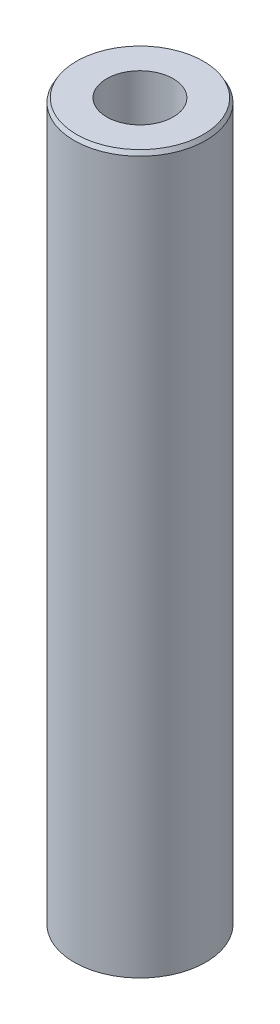
ISO-10303-21;
HEADER;
FILE_DESCRIPTION(('STEP AP214'),'2;1');
FILE_NAME('part.step','',(''),(''),'','','');
FILE_SCHEMA(('AUTOMOTIVE_DESIGN { 1 0 10303 214 1 1 1 1 }'));
ENDSEC;
DATA;
#1=APPLICATION_CONTEXT('core data for automotive mechanical design processes');
#2=APPLICATION_PROTOCOL_DEFINITION('international standard','automotive_design',2000,#1);
#3=PRODUCT_CONTEXT('',#1,'mechanical');
#4=PRODUCT('Part','Part','',(#3));
#5=PRODUCT_RELATED_PRODUCT_CATEGORY('part','',(#4));
#6=PRODUCT_DEFINITION_FORMATION('','',#4);
#7=PRODUCT_DEFINITION_CONTEXT('part definition',#1,'design');
#8=PRODUCT_DEFINITION('design','',#6,#7);
#9=PRODUCT_DEFINITION_SHAPE('','',#8);
#10=(LENGTH_UNIT() NAMED_UNIT(*) SI_UNIT(.MILLI.,.METRE.));
#11=(NAMED_UNIT(*) PLANE_ANGLE_UNIT() SI_UNIT($,.RADIAN.));
#12=(NAMED_UNIT(*) SI_UNIT($,.STERADIAN.) SOLID_ANGLE_UNIT());
#13=UNCERTAINTY_MEASURE_WITH_UNIT(LENGTH_MEASURE(1.E-05),#10,'distance_accuracy_value','');
#14=(GEOMETRIC_REPRESENTATION_CONTEXT(3) GLOBAL_UNCERTAINTY_ASSIGNED_CONTEXT((#13)) GLOBAL_UNIT_ASSIGNED_CONTEXT((#10,
#11,#12)) REPRESENTATION_CONTEXT('',''));
#15=CARTESIAN_POINT('',(0.,0.,0.));
#16=DIRECTION('',(0.,0.,1.));
#17=DIRECTION('',(1.,0.,0.));
#18=AXIS2_PLACEMENT_3D('',#15,#16,#17);
#19=CARTESIAN_POINT('',(0.,600.,0.));
#20=DIRECTION('',(0.,-1.,0.));
#21=DIRECTION('',(0.,0.,-1.));
#22=AXIS2_PLACEMENT_3D('',#19,#20,#21);
#23=CYLINDRICAL_SURFACE('',#22,55.);
#24=CARTESIAN_POINT('',(0.,596.589559710967,0.));
#25=DIRECTION('',(0.,1.,0.));
#26=DIRECTION('',(0.,0.,1.));
#27=AXIS2_PLACEMENT_3D('',#24,#25,#26);
#28=CIRCLE('',#27,55.);
#29=CARTESIAN_POINT('',(0.,596.589559710967,55.));
#30=VERTEX_POINT('',#29);
#31=EDGE_CURVE('E50',#30,#30,#28,.F.);
#32=ORIENTED_EDGE('',*,*,#31,.T.);
#33=EDGE_LOOP('',(#32));
#34=FACE_BOUND('',#33,.T.);
#35=CARTESIAN_POINT('',(0.,1.96901861892829,0.));
#36=DIRECTION('',(0.,1.,0.));
#37=DIRECTION('',(0.,0.,1.));
#38=AXIS2_PLACEMENT_3D('',#35,#36,#37);
#39=CIRCLE('',#38,55.);
#40=CARTESIAN_POINT('',(0.,1.96901861892829,55.));
#41=VERTEX_POINT('',#40);
#42=EDGE_CURVE('E51',#41,#41,#39,.T.);
#43=ORIENTED_EDGE('',*,*,#42,.T.);
#44=EDGE_LOOP('',(#43));
#45=FACE_BOUND('',#44,.T.);
#46=ADVANCED_FACE('F39',(#34,#45),#23,.T.);
#47=CARTESIAN_POINT('',(0.,600.,0.));
#48=DIRECTION('',(0.,1.,0.));
#49=DIRECTION('',(0.,0.,1.));
#50=AXIS2_PLACEMENT_3D('',#47,#48,#49);
#51=PLANE('',#50);
#52=CARTESIAN_POINT('',(0.,600.,0.));
#53=DIRECTION('',(0.,1.,0.));
#54=DIRECTION('',(0.,0.,1.));
#55=AXIS2_PLACEMENT_3D('',#52,#53,#54);
#56=CIRCLE('',#55,53.0309813810718);
#57=CARTESIAN_POINT('',(0.,600.,53.0309813810718));
#58=VERTEX_POINT('',#57);
#59=EDGE_CURVE('E54',#58,#58,#56,.T.);
#60=ORIENTED_EDGE('',*,*,#59,.T.);
#61=EDGE_LOOP('',(#60));
#62=FACE_BOUND('',#61,.T.);
#63=CARTESIAN_POINT('',(0.,600.,0.));
#64=DIRECTION('',(0.,1.,0.));
#65=DIRECTION('',(0.,0.,1.));
#66=AXIS2_PLACEMENT_3D('',#63,#64,#65);
#67=CIRCLE('',#66,27.7655503738303);
#68=CARTESIAN_POINT('',(0.,600.,27.7655503738303));
#69=VERTEX_POINT('',#68);
#70=EDGE_CURVE('E58',#69,#69,#67,.T.);
#71=ORIENTED_EDGE('',*,*,#70,.F.);
#72=EDGE_LOOP('',(#71));
#73=FACE_BOUND('',#72,.T.);
#74=ADVANCED_FACE('F69',(#62,#73),#51,.T.);
#75=CARTESIAN_POINT('',(0.,0.,0.));
#76=DIRECTION('',(0.,1.,0.));
#77=DIRECTION('',(0.,0.,1.));
#78=AXIS2_PLACEMENT_3D('',#75,#76,#77);
#79=PLANE('',#78);
#80=CARTESIAN_POINT('',(0.,0.,0.));
#81=DIRECTION('',(0.,1.,0.));
#82=DIRECTION('',(0.,0.,1.));
#83=AXIS2_PLACEMENT_3D('',#80,#81,#82);
#84=CIRCLE('',#83,51.5895597109671);
#85=CARTESIAN_POINT('',(0.,0.,51.5895597109671));
#86=VERTEX_POINT('',#85);
#87=EDGE_CURVE('E10',#86,#86,#84,.F.);
#88=ORIENTED_EDGE('',*,*,#87,.T.);
#89=EDGE_LOOP('',(#88));
#90=FACE_BOUND('',#89,.T.);
#91=CARTESIAN_POINT('',(0.,0.,0.));
#92=DIRECTION('',(0.,1.,0.));
#93=DIRECTION('',(0.,0.,1.));
#94=AXIS2_PLACEMENT_3D('',#91,#92,#93);
#95=CIRCLE('',#94,27.7655503738303);
#96=CARTESIAN_POINT('',(0.,0.,27.7655503738303));
#97=VERTEX_POINT('',#96);
#98=EDGE_CURVE('E63',#97,#97,#95,.T.);
#99=ORIENTED_EDGE('',*,*,#98,.T.);
#100=EDGE_LOOP('',(#99));
#101=FACE_BOUND('',#100,.T.);
#102=ADVANCED_FACE('F75',(#90,#101),#79,.F.);
#103=CARTESIAN_POINT('',(0.,600.,0.));
#104=DIRECTION('',(0.,-1.,0.));
#105=DIRECTION('',(0.,0.,-1.));
#106=AXIS2_PLACEMENT_3D('',#103,#104,#105);
#107=CYLINDRICAL_SURFACE('',#106,27.7655503738303);
#108=ORIENTED_EDGE('',*,*,#70,.T.);
#109=EDGE_LOOP('',(#108));
#110=FACE_BOUND('',#109,.T.);
#111=ORIENTED_EDGE('',*,*,#98,.F.);
#112=EDGE_LOOP('',(#111));
#113=FACE_BOUND('',#112,.T.);
#114=ADVANCED_FACE('F70',(#110,#113),#107,.F.);
#115=CARTESIAN_POINT('',(0.,600.,0.));
#116=DIRECTION('',(0.,-1.,0.));
#117=DIRECTION('',(0.,0.,-1.));
#118=AXIS2_PLACEMENT_3D('',#115,#116,#117);
#119=CONICAL_SURFACE('',#118,53.0309813810718,0.5235987755983);
#120=ORIENTED_EDGE('',*,*,#31,.F.);
#121=EDGE_LOOP('',(#120));
#122=FACE_BOUND('',#121,.T.);
#123=ORIENTED_EDGE('',*,*,#59,.F.);
#124=EDGE_LOOP('',(#123));
#125=FACE_BOUND('',#124,.T.);
#126=ADVANCED_FACE('F81',(#122,#125),#119,.T.);
#127=CARTESIAN_POINT('',(0.,1.96901861892829,0.));
#128=DIRECTION('',(0.,1.,0.));
#129=DIRECTION('',(0.,0.,1.));
#130=AXIS2_PLACEMENT_3D('',#127,#128,#129);
#131=CONICAL_SURFACE('',#130,55.,1.0471975511966);
#132=ORIENTED_EDGE('',*,*,#87,.F.);
#133=EDGE_LOOP('',(#132));
#134=FACE_BOUND('',#133,.T.);
#135=ORIENTED_EDGE('',*,*,#42,.F.);
#136=EDGE_LOOP('',(#135));
#137=FACE_BOUND('',#136,.T.);
#138=ADVANCED_FACE('F45',(#134,#137),#131,.T.);
#139=CLOSED_SHELL('',(#46,#74,#102,#114,#126,#138));
#140=MANIFOLD_SOLID_BREP('B2',#139);
#141=ADVANCED_BREP_SHAPE_REPRESENTATION('',(#18,#140),#14);
#142=SHAPE_DEFINITION_REPRESENTATION(#9,#141);
ENDSEC;
END-ISO-10303-21;
